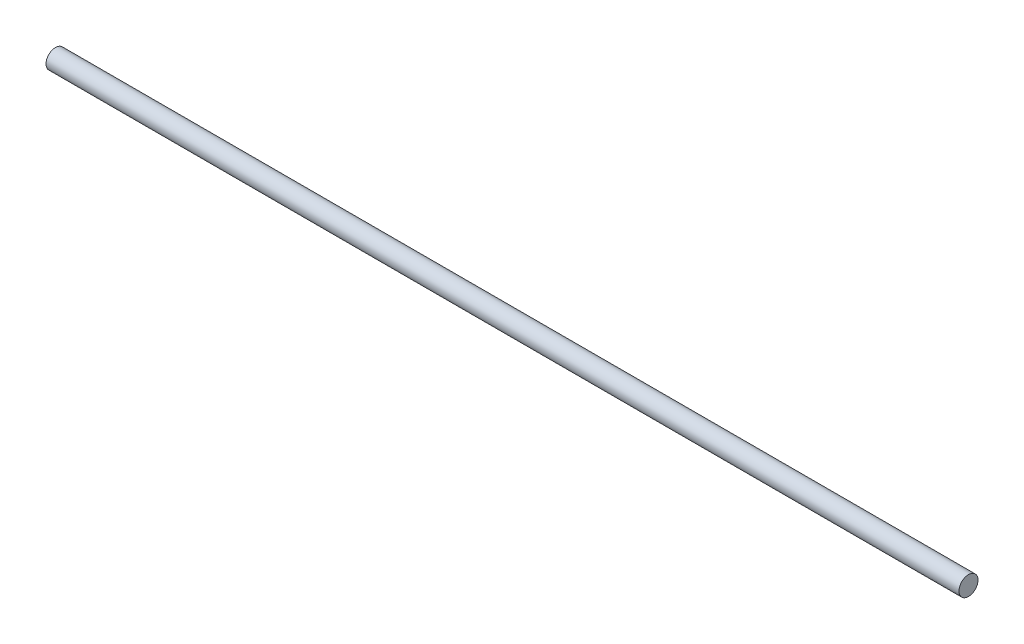
ISO-10303-21;
HEADER;
FILE_DESCRIPTION(('STEP AP214'),'2;1');
FILE_NAME('part.step','',(''),(''),'','','');
FILE_SCHEMA(('AUTOMOTIVE_DESIGN { 1 0 10303 214 1 1 1 1 }'));
ENDSEC;
DATA;
#1=APPLICATION_CONTEXT('core data for automotive mechanical design processes');
#2=APPLICATION_PROTOCOL_DEFINITION('international standard','automotive_design',2000,#1);
#3=PRODUCT_CONTEXT('',#1,'mechanical');
#4=PRODUCT('Part','Part','',(#3));
#5=PRODUCT_RELATED_PRODUCT_CATEGORY('part','',(#4));
#6=PRODUCT_DEFINITION_FORMATION('','',#4);
#7=PRODUCT_DEFINITION_CONTEXT('part definition',#1,'design');
#8=PRODUCT_DEFINITION('design','',#6,#7);
#9=PRODUCT_DEFINITION_SHAPE('','',#8);
#10=(LENGTH_UNIT() NAMED_UNIT(*) SI_UNIT(.MILLI.,.METRE.));
#11=(NAMED_UNIT(*) PLANE_ANGLE_UNIT() SI_UNIT($,.RADIAN.));
#12=(NAMED_UNIT(*) SI_UNIT($,.STERADIAN.) SOLID_ANGLE_UNIT());
#13=UNCERTAINTY_MEASURE_WITH_UNIT(LENGTH_MEASURE(1.E-05),#10,'distance_accuracy_value','');
#14=(GEOMETRIC_REPRESENTATION_CONTEXT(3) GLOBAL_UNCERTAINTY_ASSIGNED_CONTEXT((#13)) GLOBAL_UNIT_ASSIGNED_CONTEXT((#10,
#11,#12)) REPRESENTATION_CONTEXT('',''));
#15=CARTESIAN_POINT('',(0.,0.,0.));
#16=DIRECTION('',(0.,0.,1.));
#17=DIRECTION('',(1.,0.,0.));
#18=AXIS2_PLACEMENT_3D('',#15,#16,#17);
#19=CARTESIAN_POINT('',(0.,0.,0.));
#20=DIRECTION('',(-1.,0.,0.));
#21=DIRECTION('',(0.,0.,1.));
#22=AXIS2_PLACEMENT_3D('',#19,#20,#21);
#23=PLANE('',#22);
#24=CARTESIAN_POINT('',(0.,0.,0.));
#25=DIRECTION('',(-1.,0.,0.));
#26=DIRECTION('',(0.,0.,1.));
#27=AXIS2_PLACEMENT_3D('',#24,#25,#26);
#28=CIRCLE('',#27,9.525);
#29=CARTESIAN_POINT('',(0.,0.,9.525));
#30=VERTEX_POINT('',#29);
#31=EDGE_CURVE('E47',#30,#30,#28,.T.);
#32=ORIENTED_EDGE('',*,*,#31,.F.);
#33=EDGE_LOOP('',(#32));
#34=FACE_BOUND('',#33,.T.);
#35=ADVANCED_FACE('F40',(#34),#23,.F.);
#36=CARTESIAN_POINT('',(-914.4,0.,1.11981703314034E-13));
#37=DIRECTION('',(-1.,0.,0.));
#38=DIRECTION('',(0.,0.,1.));
#39=AXIS2_PLACEMENT_3D('',#36,#37,#38);
#40=PLANE('',#39);
#41=CARTESIAN_POINT('',(-914.4,0.,1.11981703314034E-13));
#42=DIRECTION('',(-1.,0.,0.));
#43=DIRECTION('',(0.,0.,1.));
#44=AXIS2_PLACEMENT_3D('',#41,#42,#43);
#45=CIRCLE('',#44,9.525);
#46=CARTESIAN_POINT('',(-914.4,0.,9.52500000000011));
#47=VERTEX_POINT('',#46);
#48=EDGE_CURVE('E12',#47,#47,#45,.T.);
#49=ORIENTED_EDGE('',*,*,#48,.T.);
#50=EDGE_LOOP('',(#49));
#51=FACE_BOUND('',#50,.T.);
#52=ADVANCED_FACE('F54',(#51),#40,.T.);
#53=CARTESIAN_POINT('',(0.,0.,0.));
#54=DIRECTION('',(-1.,0.,0.));
#55=DIRECTION('',(0.,0.,1.));
#56=AXIS2_PLACEMENT_3D('',#53,#54,#55);
#57=CYLINDRICAL_SURFACE('',#56,9.525);
#58=ORIENTED_EDGE('',*,*,#48,.F.);
#59=EDGE_LOOP('',(#58));
#60=FACE_BOUND('',#59,.T.);
#61=ORIENTED_EDGE('',*,*,#31,.T.);
#62=EDGE_LOOP('',(#61));
#63=FACE_BOUND('',#62,.T.);
#64=ADVANCED_FACE('F56',(#60,#63),#57,.T.);
#65=CLOSED_SHELL('',(#35,#52,#64));
#66=MANIFOLD_SOLID_BREP('B2',#65);
#67=ADVANCED_BREP_SHAPE_REPRESENTATION('',(#18,#66),#14);
#68=SHAPE_DEFINITION_REPRESENTATION(#9,#67);
ENDSEC;
END-ISO-10303-21;
